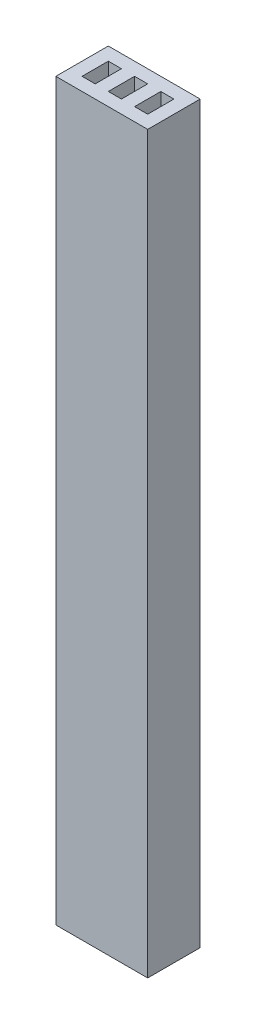
ISO-10303-21;
HEADER;
FILE_DESCRIPTION(('STEP AP214'),'2;1');
FILE_NAME('part.step','',(''),(''),'','','');
FILE_SCHEMA(('AUTOMOTIVE_DESIGN { 1 0 10303 214 1 1 1 1 }'));
ENDSEC;
DATA;
#1=APPLICATION_CONTEXT('core data for automotive mechanical design processes');
#2=APPLICATION_PROTOCOL_DEFINITION('international standard','automotive_design',2000,#1);
#3=PRODUCT_CONTEXT('',#1,'mechanical');
#4=PRODUCT('Part','Part','',(#3));
#5=PRODUCT_RELATED_PRODUCT_CATEGORY('part','',(#4));
#6=PRODUCT_DEFINITION_FORMATION('','',#4);
#7=PRODUCT_DEFINITION_CONTEXT('part definition',#1,'design');
#8=PRODUCT_DEFINITION('design','',#6,#7);
#9=PRODUCT_DEFINITION_SHAPE('','',#8);
#10=(LENGTH_UNIT() NAMED_UNIT(*) SI_UNIT(.MILLI.,.METRE.));
#11=(NAMED_UNIT(*) PLANE_ANGLE_UNIT() SI_UNIT($,.RADIAN.));
#12=(NAMED_UNIT(*) SI_UNIT($,.STERADIAN.) SOLID_ANGLE_UNIT());
#13=UNCERTAINTY_MEASURE_WITH_UNIT(LENGTH_MEASURE(1.E-05),#10,'distance_accuracy_value','');
#14=(GEOMETRIC_REPRESENTATION_CONTEXT(3) GLOBAL_UNCERTAINTY_ASSIGNED_CONTEXT((#13)) GLOBAL_UNIT_ASSIGNED_CONTEXT((#10,
#11,#12)) REPRESENTATION_CONTEXT('',''));
#15=CARTESIAN_POINT('',(0.,0.,0.));
#16=DIRECTION('',(0.,0.,1.));
#17=DIRECTION('',(1.,0.,0.));
#18=AXIS2_PLACEMENT_3D('',#15,#16,#17);
#19=CARTESIAN_POINT('',(0.,56.,0.));
#20=DIRECTION('',(0.,1.,0.));
#21=DIRECTION('',(0.,0.,1.));
#22=AXIS2_PLACEMENT_3D('',#19,#20,#21);
#23=PLANE('',#22);
#24=DIRECTION('',(0.,0.,-1.));
#25=VECTOR('',#24,1.);
#26=CARTESIAN_POINT('',(0.183947771505097,56.,0.763376857079086));
#27=LINE('',#26,#25);
#28=CARTESIAN_POINT('',(0.183947771505097,56.,4.76337685707909));
#29=VERTEX_POINT('',#28);
#30=CARTESIAN_POINT('',(0.183947771505097,56.,0.763376857079086));
#31=VERTEX_POINT('',#30);
#32=EDGE_CURVE('E244',#29,#31,#27,.T.);
#33=ORIENTED_EDGE('',*,*,#32,.T.);
#34=DIRECTION('',(-1.,0.,0.));
#35=VECTOR('',#34,1.);
#36=CARTESIAN_POINT('',(-6.8160522284949,56.,0.763376857079086));
#37=LINE('',#36,#35);
#38=CARTESIAN_POINT('',(-6.8160522284949,56.,0.763376857079086));
#39=VERTEX_POINT('',#38);
#40=EDGE_CURVE('E247',#31,#39,#37,.T.);
#41=ORIENTED_EDGE('',*,*,#40,.T.);
#42=DIRECTION('',(0.,0.,1.));
#43=VECTOR('',#42,1.);
#44=CARTESIAN_POINT('',(-6.8160522284949,56.,0.763376857079086));
#45=LINE('',#44,#43);
#46=CARTESIAN_POINT('',(-6.8160522284949,56.,4.76337685707909));
#47=VERTEX_POINT('',#46);
#48=EDGE_CURVE('E250',#39,#47,#45,.T.);
#49=ORIENTED_EDGE('',*,*,#48,.T.);
#50=DIRECTION('',(1.,0.,0.));
#51=VECTOR('',#50,1.);
#52=CARTESIAN_POINT('',(-6.8160522284949,56.,4.76337685707909));
#53=LINE('',#52,#51);
#54=EDGE_CURVE('E252',#47,#29,#53,.T.);
#55=ORIENTED_EDGE('',*,*,#54,.T.);
#56=EDGE_LOOP('',(#33,#41,#49,#55));
#57=FACE_BOUND('',#56,.T.);
#58=DIRECTION('',(1.,0.,0.));
#59=VECTOR('',#58,1.);
#60=CARTESIAN_POINT('',(-5.8160522284949,56.,3.76337685707909));
#61=LINE('',#60,#59);
#62=CARTESIAN_POINT('',(-5.8160522284949,56.,3.76337685707909));
#63=VERTEX_POINT('',#62);
#64=CARTESIAN_POINT('',(-4.8160522284949,56.,3.76337685707909));
#65=VERTEX_POINT('',#64);
#66=EDGE_CURVE('E215',#63,#65,#61,.T.);
#67=ORIENTED_EDGE('',*,*,#66,.F.);
#68=DIRECTION('',(0.,0.,1.));
#69=VECTOR('',#68,1.);
#70=CARTESIAN_POINT('',(-5.8160522284949,56.,3.76337685707909));
#71=LINE('',#70,#69);
#72=CARTESIAN_POINT('',(-5.8160522284949,56.,1.76337685707909));
#73=VERTEX_POINT('',#72);
#74=EDGE_CURVE('E213',#73,#63,#71,.T.);
#75=ORIENTED_EDGE('',*,*,#74,.F.);
#76=DIRECTION('',(-1.,0.,0.));
#77=VECTOR('',#76,1.);
#78=CARTESIAN_POINT('',(-5.8160522284949,56.,1.76337685707909));
#79=LINE('',#78,#77);
#80=CARTESIAN_POINT('',(-4.8160522284949,56.,1.76337685707909));
#81=VERTEX_POINT('',#80);
#82=EDGE_CURVE('E221',#81,#73,#79,.T.);
#83=ORIENTED_EDGE('',*,*,#82,.F.);
#84=DIRECTION('',(0.,0.,-1.));
#85=VECTOR('',#84,1.);
#86=CARTESIAN_POINT('',(-4.8160522284949,56.,3.76337685707909));
#87=LINE('',#86,#85);
#88=EDGE_CURVE('E218',#65,#81,#87,.T.);
#89=ORIENTED_EDGE('',*,*,#88,.F.);
#90=EDGE_LOOP('',(#67,#75,#83,#89));
#91=FACE_BOUND('',#90,.T.);
#92=DIRECTION('',(-1.,0.,0.));
#93=VECTOR('',#92,1.);
#94=CARTESIAN_POINT('',(-3.8160522284949,56.,1.76337685707909));
#95=LINE('',#94,#93);
#96=CARTESIAN_POINT('',(-2.8160522284949,56.,1.76337685707909));
#97=VERTEX_POINT('',#96);
#98=CARTESIAN_POINT('',(-3.8160522284949,56.,1.76337685707909));
#99=VERTEX_POINT('',#98);
#100=EDGE_CURVE('E184',#97,#99,#95,.T.);
#101=ORIENTED_EDGE('',*,*,#100,.F.);
#102=DIRECTION('',(0.,0.,-1.));
#103=VECTOR('',#102,1.);
#104=CARTESIAN_POINT('',(-2.8160522284949,56.,3.76337685707909));
#105=LINE('',#104,#103);
#106=CARTESIAN_POINT('',(-2.8160522284949,56.,3.76337685707909));
#107=VERTEX_POINT('',#106);
#108=EDGE_CURVE('E182',#107,#97,#105,.T.);
#109=ORIENTED_EDGE('',*,*,#108,.F.);
#110=DIRECTION('',(1.,0.,0.));
#111=VECTOR('',#110,1.);
#112=CARTESIAN_POINT('',(-3.8160522284949,56.,3.76337685707909));
#113=LINE('',#112,#111);
#114=CARTESIAN_POINT('',(-3.8160522284949,56.,3.76337685707909));
#115=VERTEX_POINT('',#114);
#116=EDGE_CURVE('E190',#115,#107,#113,.T.);
#117=ORIENTED_EDGE('',*,*,#116,.F.);
#118=DIRECTION('',(0.,0.,1.));
#119=VECTOR('',#118,1.);
#120=CARTESIAN_POINT('',(-3.8160522284949,56.,3.76337685707909));
#121=LINE('',#120,#119);
#122=EDGE_CURVE('E187',#99,#115,#121,.T.);
#123=ORIENTED_EDGE('',*,*,#122,.F.);
#124=EDGE_LOOP('',(#101,#109,#117,#123));
#125=FACE_BOUND('',#124,.T.);
#126=DIRECTION('',(-1.,0.,0.));
#127=VECTOR('',#126,1.);
#128=CARTESIAN_POINT('',(-1.8160522284949,56.,1.76337685707909));
#129=LINE('',#128,#127);
#130=CARTESIAN_POINT('',(-0.816052228494903,56.,1.76337685707909));
#131=VERTEX_POINT('',#130);
#132=CARTESIAN_POINT('',(-1.8160522284949,56.,1.76337685707909));
#133=VERTEX_POINT('',#132);
#134=EDGE_CURVE('E154',#131,#133,#129,.T.);
#135=ORIENTED_EDGE('',*,*,#134,.F.);
#136=DIRECTION('',(0.,0.,-1.));
#137=VECTOR('',#136,1.);
#138=CARTESIAN_POINT('',(-0.816052228494903,56.,3.76337685707909));
#139=LINE('',#138,#137);
#140=CARTESIAN_POINT('',(-0.816052228494903,56.,3.76337685707909));
#141=VERTEX_POINT('',#140);
#142=EDGE_CURVE('E146',#141,#131,#139,.T.);
#143=ORIENTED_EDGE('',*,*,#142,.F.);
#144=DIRECTION('',(1.,0.,0.));
#145=VECTOR('',#144,1.);
#146=CARTESIAN_POINT('',(-1.8160522284949,56.,3.76337685707909));
#147=LINE('',#146,#145);
#148=CARTESIAN_POINT('',(-1.8160522284949,56.,3.76337685707909));
#149=VERTEX_POINT('',#148);
#150=EDGE_CURVE('E168',#149,#141,#147,.T.);
#151=ORIENTED_EDGE('',*,*,#150,.F.);
#152=DIRECTION('',(0.,0.,1.));
#153=VECTOR('',#152,1.);
#154=CARTESIAN_POINT('',(-1.8160522284949,56.,3.76337685707909));
#155=LINE('',#154,#153);
#156=EDGE_CURVE('E166',#133,#149,#155,.T.);
#157=ORIENTED_EDGE('',*,*,#156,.F.);
#158=EDGE_LOOP('',(#135,#143,#151,#157));
#159=FACE_BOUND('',#158,.T.);
#160=ADVANCED_FACE('F33',(#57,#91,#125,#159),#23,.T.);
#161=CARTESIAN_POINT('',(0.,0.,0.));
#162=DIRECTION('',(0.,1.,0.));
#163=DIRECTION('',(0.,0.,1.));
#164=AXIS2_PLACEMENT_3D('',#161,#162,#163);
#165=PLANE('',#164);
#166=DIRECTION('',(0.,0.,-1.));
#167=VECTOR('',#166,1.);
#168=CARTESIAN_POINT('',(-2.8160522284949,0.,3.76337685707909));
#169=LINE('',#168,#167);
#170=CARTESIAN_POINT('',(-2.8160522284949,0.,3.76337685707909));
#171=VERTEX_POINT('',#170);
#172=CARTESIAN_POINT('',(-2.8160522284949,0.,1.76337685707909));
#173=VERTEX_POINT('',#172);
#174=EDGE_CURVE('E162',#171,#173,#169,.T.);
#175=ORIENTED_EDGE('',*,*,#174,.T.);
#176=DIRECTION('',(-1.,0.,0.));
#177=VECTOR('',#176,1.);
#178=CARTESIAN_POINT('',(-3.8160522284949,0.,1.76337685707909));
#179=LINE('',#178,#177);
#180=CARTESIAN_POINT('',(-3.8160522284949,0.,1.76337685707909));
#181=VERTEX_POINT('',#180);
#182=EDGE_CURVE('E195',#173,#181,#179,.T.);
#183=ORIENTED_EDGE('',*,*,#182,.T.);
#184=DIRECTION('',(0.,0.,1.));
#185=VECTOR('',#184,1.);
#186=CARTESIAN_POINT('',(-3.8160522284949,0.,3.76337685707909));
#187=LINE('',#186,#185);
#188=CARTESIAN_POINT('',(-3.8160522284949,0.,3.76337685707909));
#189=VERTEX_POINT('',#188);
#190=EDGE_CURVE('E198',#181,#189,#187,.T.);
#191=ORIENTED_EDGE('',*,*,#190,.T.);
#192=DIRECTION('',(1.,0.,0.));
#193=VECTOR('',#192,1.);
#194=CARTESIAN_POINT('',(-3.8160522284949,0.,3.76337685707909));
#195=LINE('',#194,#193);
#196=EDGE_CURVE('E185',#189,#171,#195,.T.);
#197=ORIENTED_EDGE('',*,*,#196,.T.);
#198=EDGE_LOOP('',(#175,#183,#191,#197));
#199=FACE_BOUND('',#198,.T.);
#200=DIRECTION('',(0.,0.,-1.));
#201=VECTOR('',#200,1.);
#202=CARTESIAN_POINT('',(0.183947771505097,0.,0.763376857079086));
#203=LINE('',#202,#201);
#204=CARTESIAN_POINT('',(0.183947771505097,0.,4.76337685707909));
#205=VERTEX_POINT('',#204);
#206=CARTESIAN_POINT('',(0.183947771505097,0.,0.763376857079086));
#207=VERTEX_POINT('',#206);
#208=EDGE_CURVE('E243',#205,#207,#203,.T.);
#209=ORIENTED_EDGE('',*,*,#208,.F.);
#210=DIRECTION('',(1.,0.,0.));
#211=VECTOR('',#210,1.);
#212=CARTESIAN_POINT('',(-6.8160522284949,0.,4.76337685707909));
#213=LINE('',#212,#211);
#214=CARTESIAN_POINT('',(-6.8160522284949,0.,4.76337685707909));
#215=VERTEX_POINT('',#214);
#216=EDGE_CURVE('E248',#215,#205,#213,.T.);
#217=ORIENTED_EDGE('',*,*,#216,.F.);
#218=DIRECTION('',(0.,0.,1.));
#219=VECTOR('',#218,1.);
#220=CARTESIAN_POINT('',(-6.8160522284949,0.,0.763376857079086));
#221=LINE('',#220,#219);
#222=CARTESIAN_POINT('',(-6.8160522284949,0.,0.763376857079086));
#223=VERTEX_POINT('',#222);
#224=EDGE_CURVE('E259',#223,#215,#221,.T.);
#225=ORIENTED_EDGE('',*,*,#224,.F.);
#226=DIRECTION('',(-1.,0.,0.));
#227=VECTOR('',#226,1.);
#228=CARTESIAN_POINT('',(-6.8160522284949,0.,0.763376857079086));
#229=LINE('',#228,#227);
#230=EDGE_CURVE('E257',#207,#223,#229,.T.);
#231=ORIENTED_EDGE('',*,*,#230,.F.);
#232=EDGE_LOOP('',(#209,#217,#225,#231));
#233=FACE_BOUND('',#232,.T.);
#234=DIRECTION('',(0.,0.,1.));
#235=VECTOR('',#234,1.);
#236=CARTESIAN_POINT('',(-5.8160522284949,0.,3.76337685707909));
#237=LINE('',#236,#235);
#238=CARTESIAN_POINT('',(-5.8160522284949,0.,1.76337685707909));
#239=VERTEX_POINT('',#238);
#240=CARTESIAN_POINT('',(-5.8160522284949,0.,3.76337685707909));
#241=VERTEX_POINT('',#240);
#242=EDGE_CURVE('E212',#239,#241,#237,.T.);
#243=ORIENTED_EDGE('',*,*,#242,.T.);
#244=DIRECTION('',(1.,0.,0.));
#245=VECTOR('',#244,1.);
#246=CARTESIAN_POINT('',(-5.8160522284949,0.,3.76337685707909));
#247=LINE('',#246,#245);
#248=CARTESIAN_POINT('',(-4.8160522284949,0.,3.76337685707909));
#249=VERTEX_POINT('',#248);
#250=EDGE_CURVE('E226',#241,#249,#247,.T.);
#251=ORIENTED_EDGE('',*,*,#250,.T.);
#252=DIRECTION('',(0.,0.,-1.));
#253=VECTOR('',#252,1.);
#254=CARTESIAN_POINT('',(-4.8160522284949,0.,3.76337685707909));
#255=LINE('',#254,#253);
#256=CARTESIAN_POINT('',(-4.8160522284949,0.,1.76337685707909));
#257=VERTEX_POINT('',#256);
#258=EDGE_CURVE('E229',#249,#257,#255,.T.);
#259=ORIENTED_EDGE('',*,*,#258,.T.);
#260=DIRECTION('',(-1.,0.,0.));
#261=VECTOR('',#260,1.);
#262=CARTESIAN_POINT('',(-5.8160522284949,0.,1.76337685707909));
#263=LINE('',#262,#261);
#264=EDGE_CURVE('E216',#257,#239,#263,.T.);
#265=ORIENTED_EDGE('',*,*,#264,.T.);
#266=EDGE_LOOP('',(#243,#251,#259,#265));
#267=FACE_BOUND('',#266,.T.);
#268=DIRECTION('',(0.,0.,-1.));
#269=VECTOR('',#268,1.);
#270=CARTESIAN_POINT('',(-0.816052228494903,0.,3.76337685707909));
#271=LINE('',#270,#269);
#272=CARTESIAN_POINT('',(-0.816052228494903,0.,3.76337685707909));
#273=VERTEX_POINT('',#272);
#274=CARTESIAN_POINT('',(-0.816052228494903,0.,1.76337685707909));
#275=VERTEX_POINT('',#274);
#276=EDGE_CURVE('E56',#273,#275,#271,.T.);
#277=ORIENTED_EDGE('',*,*,#276,.T.);
#278=DIRECTION('',(-1.,0.,0.));
#279=VECTOR('',#278,1.);
#280=CARTESIAN_POINT('',(-1.8160522284949,0.,1.76337685707909));
#281=LINE('',#280,#279);
#282=CARTESIAN_POINT('',(-1.8160522284949,0.,1.76337685707909));
#283=VERTEX_POINT('',#282);
#284=EDGE_CURVE('E161',#275,#283,#281,.T.);
#285=ORIENTED_EDGE('',*,*,#284,.T.);
#286=DIRECTION('',(0.,0.,1.));
#287=VECTOR('',#286,1.);
#288=CARTESIAN_POINT('',(-1.8160522284949,0.,3.76337685707909));
#289=LINE('',#288,#287);
#290=CARTESIAN_POINT('',(-1.8160522284949,0.,3.76337685707909));
#291=VERTEX_POINT('',#290);
#292=EDGE_CURVE('E174',#283,#291,#289,.T.);
#293=ORIENTED_EDGE('',*,*,#292,.T.);
#294=DIRECTION('',(1.,0.,0.));
#295=VECTOR('',#294,1.);
#296=CARTESIAN_POINT('',(-1.8160522284949,0.,3.76337685707909));
#297=LINE('',#296,#295);
#298=EDGE_CURVE('E155',#291,#273,#297,.T.);
#299=ORIENTED_EDGE('',*,*,#298,.T.);
#300=EDGE_LOOP('',(#277,#285,#293,#299));
#301=FACE_BOUND('',#300,.T.);
#302=ADVANCED_FACE('F277',(#199,#233,#267,#301),#165,.F.);
#303=CARTESIAN_POINT('',(0.183947771505097,56.,0.763376857079086));
#304=DIRECTION('',(-1.,0.,0.));
#305=DIRECTION('',(0.,0.,1.));
#306=AXIS2_PLACEMENT_3D('',#303,#304,#305);
#307=PLANE('',#306);
#308=ORIENTED_EDGE('',*,*,#208,.T.);
#309=DIRECTION('',(0.,-1.,0.));
#310=VECTOR('',#309,1.);
#311=CARTESIAN_POINT('',(0.183947771505097,56.,0.763376857079086));
#312=LINE('',#311,#310);
#313=EDGE_CURVE('E11',#31,#207,#312,.T.);
#314=ORIENTED_EDGE('',*,*,#313,.F.);
#315=ORIENTED_EDGE('',*,*,#32,.F.);
#316=DIRECTION('',(0.,-1.,0.));
#317=VECTOR('',#316,1.);
#318=CARTESIAN_POINT('',(0.183947771505097,56.,4.76337685707909));
#319=LINE('',#318,#317);
#320=EDGE_CURVE('E254',#29,#205,#319,.T.);
#321=ORIENTED_EDGE('',*,*,#320,.T.);
#322=EDGE_LOOP('',(#308,#314,#315,#321));
#323=FACE_BOUND('',#322,.T.);
#324=ADVANCED_FACE('F35',(#323),#307,.F.);
#325=CARTESIAN_POINT('',(-6.8160522284949,56.,0.763376857079086));
#326=DIRECTION('',(0.,0.,1.));
#327=DIRECTION('',(1.,0.,0.));
#328=AXIS2_PLACEMENT_3D('',#325,#326,#327);
#329=PLANE('',#328);
#330=ORIENTED_EDGE('',*,*,#230,.T.);
#331=DIRECTION('',(0.,-1.,0.));
#332=VECTOR('',#331,1.);
#333=CARTESIAN_POINT('',(-6.8160522284949,56.,0.763376857079086));
#334=LINE('',#333,#332);
#335=EDGE_CURVE('E41',#39,#223,#334,.T.);
#336=ORIENTED_EDGE('',*,*,#335,.F.);
#337=ORIENTED_EDGE('',*,*,#40,.F.);
#338=ORIENTED_EDGE('',*,*,#313,.T.);
#339=EDGE_LOOP('',(#330,#336,#337,#338));
#340=FACE_BOUND('',#339,.T.);
#341=ADVANCED_FACE('F288',(#340),#329,.F.);
#342=CARTESIAN_POINT('',(-6.8160522284949,56.,0.763376857079086));
#343=DIRECTION('',(1.,0.,0.));
#344=DIRECTION('',(0.,0.,-1.));
#345=AXIS2_PLACEMENT_3D('',#342,#343,#344);
#346=PLANE('',#345);
#347=ORIENTED_EDGE('',*,*,#224,.T.);
#348=DIRECTION('',(0.,-1.,0.));
#349=VECTOR('',#348,1.);
#350=CARTESIAN_POINT('',(-6.8160522284949,56.,4.76337685707909));
#351=LINE('',#350,#349);
#352=EDGE_CURVE('E264',#47,#215,#351,.T.);
#353=ORIENTED_EDGE('',*,*,#352,.F.);
#354=ORIENTED_EDGE('',*,*,#48,.F.);
#355=ORIENTED_EDGE('',*,*,#335,.T.);
#356=EDGE_LOOP('',(#347,#353,#354,#355));
#357=FACE_BOUND('',#356,.T.);
#358=ADVANCED_FACE('F271',(#357),#346,.F.);
#359=CARTESIAN_POINT('',(-6.8160522284949,56.,4.76337685707909));
#360=DIRECTION('',(0.,0.,-1.));
#361=DIRECTION('',(-1.,0.,0.));
#362=AXIS2_PLACEMENT_3D('',#359,#360,#361);
#363=PLANE('',#362);
#364=ORIENTED_EDGE('',*,*,#216,.T.);
#365=ORIENTED_EDGE('',*,*,#320,.F.);
#366=ORIENTED_EDGE('',*,*,#54,.F.);
#367=ORIENTED_EDGE('',*,*,#352,.T.);
#368=EDGE_LOOP('',(#364,#365,#366,#367));
#369=FACE_BOUND('',#368,.T.);
#370=ADVANCED_FACE('F281',(#369),#363,.F.);
#371=CARTESIAN_POINT('',(-5.8160522284949,56.,3.76337685707909));
#372=DIRECTION('',(1.,0.,0.));
#373=DIRECTION('',(0.,0.,-1.));
#374=AXIS2_PLACEMENT_3D('',#371,#372,#373);
#375=PLANE('',#374);
#376=ORIENTED_EDGE('',*,*,#242,.F.);
#377=DIRECTION('',(0.,-1.,0.));
#378=VECTOR('',#377,1.);
#379=CARTESIAN_POINT('',(-5.8160522284949,56.,1.76337685707909));
#380=LINE('',#379,#378);
#381=EDGE_CURVE('E223',#73,#239,#380,.T.);
#382=ORIENTED_EDGE('',*,*,#381,.F.);
#383=ORIENTED_EDGE('',*,*,#74,.T.);
#384=DIRECTION('',(0.,-1.,0.));
#385=VECTOR('',#384,1.);
#386=CARTESIAN_POINT('',(-5.8160522284949,56.,3.76337685707909));
#387=LINE('',#386,#385);
#388=EDGE_CURVE('E240',#63,#241,#387,.T.);
#389=ORIENTED_EDGE('',*,*,#388,.T.);
#390=EDGE_LOOP('',(#376,#382,#383,#389));
#391=FACE_BOUND('',#390,.T.);
#392=ADVANCED_FACE('F303',(#391),#375,.T.);
#393=CARTESIAN_POINT('',(-5.8160522284949,56.,3.76337685707909));
#394=DIRECTION('',(0.,0.,-1.));
#395=DIRECTION('',(-1.,0.,0.));
#396=AXIS2_PLACEMENT_3D('',#393,#394,#395);
#397=PLANE('',#396);
#398=ORIENTED_EDGE('',*,*,#250,.F.);
#399=ORIENTED_EDGE('',*,*,#388,.F.);
#400=ORIENTED_EDGE('',*,*,#66,.T.);
#401=DIRECTION('',(0.,-1.,0.));
#402=VECTOR('',#401,1.);
#403=CARTESIAN_POINT('',(-4.8160522284949,56.,3.76337685707909));
#404=LINE('',#403,#402);
#405=EDGE_CURVE('E238',#65,#249,#404,.T.);
#406=ORIENTED_EDGE('',*,*,#405,.T.);
#407=EDGE_LOOP('',(#398,#399,#400,#406));
#408=FACE_BOUND('',#407,.T.);
#409=ADVANCED_FACE('F310',(#408),#397,.T.);
#410=CARTESIAN_POINT('',(-4.8160522284949,56.,3.76337685707909));
#411=DIRECTION('',(-1.,0.,0.));
#412=DIRECTION('',(0.,0.,1.));
#413=AXIS2_PLACEMENT_3D('',#410,#411,#412);
#414=PLANE('',#413);
#415=ORIENTED_EDGE('',*,*,#258,.F.);
#416=ORIENTED_EDGE('',*,*,#405,.F.);
#417=ORIENTED_EDGE('',*,*,#88,.T.);
#418=DIRECTION('',(0.,-1.,0.));
#419=VECTOR('',#418,1.);
#420=CARTESIAN_POINT('',(-4.8160522284949,56.,1.76337685707909));
#421=LINE('',#420,#419);
#422=EDGE_CURVE('E236',#81,#257,#421,.T.);
#423=ORIENTED_EDGE('',*,*,#422,.T.);
#424=EDGE_LOOP('',(#415,#416,#417,#423));
#425=FACE_BOUND('',#424,.T.);
#426=ADVANCED_FACE('F315',(#425),#414,.T.);
#427=CARTESIAN_POINT('',(-5.8160522284949,56.,1.76337685707909));
#428=DIRECTION('',(0.,0.,1.));
#429=DIRECTION('',(1.,0.,0.));
#430=AXIS2_PLACEMENT_3D('',#427,#428,#429);
#431=PLANE('',#430);
#432=ORIENTED_EDGE('',*,*,#264,.F.);
#433=ORIENTED_EDGE('',*,*,#422,.F.);
#434=ORIENTED_EDGE('',*,*,#82,.T.);
#435=ORIENTED_EDGE('',*,*,#381,.T.);
#436=EDGE_LOOP('',(#432,#433,#434,#435));
#437=FACE_BOUND('',#436,.T.);
#438=ADVANCED_FACE('F322',(#437),#431,.T.);
#439=CARTESIAN_POINT('',(-2.8160522284949,56.,3.76337685707909));
#440=DIRECTION('',(-1.,0.,0.));
#441=DIRECTION('',(0.,0.,1.));
#442=AXIS2_PLACEMENT_3D('',#439,#440,#441);
#443=PLANE('',#442);
#444=ORIENTED_EDGE('',*,*,#174,.F.);
#445=DIRECTION('',(0.,-1.,0.));
#446=VECTOR('',#445,1.);
#447=CARTESIAN_POINT('',(-2.8160522284949,56.,3.76337685707909));
#448=LINE('',#447,#446);
#449=EDGE_CURVE('E192',#107,#171,#448,.T.);
#450=ORIENTED_EDGE('',*,*,#449,.F.);
#451=ORIENTED_EDGE('',*,*,#108,.T.);
#452=DIRECTION('',(0.,-1.,0.));
#453=VECTOR('',#452,1.);
#454=CARTESIAN_POINT('',(-2.8160522284949,56.,1.76337685707909));
#455=LINE('',#454,#453);
#456=EDGE_CURVE('E209',#97,#173,#455,.T.);
#457=ORIENTED_EDGE('',*,*,#456,.T.);
#458=EDGE_LOOP('',(#444,#450,#451,#457));
#459=FACE_BOUND('',#458,.T.);
#460=ADVANCED_FACE('F344',(#459),#443,.T.);
#461=CARTESIAN_POINT('',(-3.8160522284949,56.,1.76337685707909));
#462=DIRECTION('',(0.,0.,1.));
#463=DIRECTION('',(1.,0.,0.));
#464=AXIS2_PLACEMENT_3D('',#461,#462,#463);
#465=PLANE('',#464);
#466=ORIENTED_EDGE('',*,*,#182,.F.);
#467=ORIENTED_EDGE('',*,*,#456,.F.);
#468=ORIENTED_EDGE('',*,*,#100,.T.);
#469=DIRECTION('',(0.,-1.,0.));
#470=VECTOR('',#469,1.);
#471=CARTESIAN_POINT('',(-3.8160522284949,56.,1.76337685707909));
#472=LINE('',#471,#470);
#473=EDGE_CURVE('E207',#99,#181,#472,.T.);
#474=ORIENTED_EDGE('',*,*,#473,.T.);
#475=EDGE_LOOP('',(#466,#467,#468,#474));
#476=FACE_BOUND('',#475,.T.);
#477=ADVANCED_FACE('F338',(#476),#465,.T.);
#478=CARTESIAN_POINT('',(-3.8160522284949,56.,3.76337685707909));
#479=DIRECTION('',(1.,0.,0.));
#480=DIRECTION('',(0.,0.,-1.));
#481=AXIS2_PLACEMENT_3D('',#478,#479,#480);
#482=PLANE('',#481);
#483=ORIENTED_EDGE('',*,*,#190,.F.);
#484=ORIENTED_EDGE('',*,*,#473,.F.);
#485=ORIENTED_EDGE('',*,*,#122,.T.);
#486=DIRECTION('',(0.,-1.,0.));
#487=VECTOR('',#486,1.);
#488=CARTESIAN_POINT('',(-3.8160522284949,56.,3.76337685707909));
#489=LINE('',#488,#487);
#490=EDGE_CURVE('E205',#115,#189,#489,.T.);
#491=ORIENTED_EDGE('',*,*,#490,.T.);
#492=EDGE_LOOP('',(#483,#484,#485,#491));
#493=FACE_BOUND('',#492,.T.);
#494=ADVANCED_FACE('F341',(#493),#482,.T.);
#495=CARTESIAN_POINT('',(-3.8160522284949,56.,3.76337685707909));
#496=DIRECTION('',(0.,0.,-1.));
#497=DIRECTION('',(-1.,0.,0.));
#498=AXIS2_PLACEMENT_3D('',#495,#496,#497);
#499=PLANE('',#498);
#500=ORIENTED_EDGE('',*,*,#196,.F.);
#501=ORIENTED_EDGE('',*,*,#490,.F.);
#502=ORIENTED_EDGE('',*,*,#116,.T.);
#503=ORIENTED_EDGE('',*,*,#449,.T.);
#504=EDGE_LOOP('',(#500,#501,#502,#503));
#505=FACE_BOUND('',#504,.T.);
#506=ADVANCED_FACE('F347',(#505),#499,.T.);
#507=CARTESIAN_POINT('',(-0.816052228494903,56.,3.76337685707909));
#508=DIRECTION('',(-1.,0.,0.));
#509=DIRECTION('',(0.,0.,1.));
#510=AXIS2_PLACEMENT_3D('',#507,#508,#509);
#511=PLANE('',#510);
#512=ORIENTED_EDGE('',*,*,#276,.F.);
#513=DIRECTION('',(0.,-1.,0.));
#514=VECTOR('',#513,1.);
#515=CARTESIAN_POINT('',(-0.816052228494903,56.,3.76337685707909));
#516=LINE('',#515,#514);
#517=EDGE_CURVE('E150',#141,#273,#516,.T.);
#518=ORIENTED_EDGE('',*,*,#517,.F.);
#519=ORIENTED_EDGE('',*,*,#142,.T.);
#520=DIRECTION('',(0.,-1.,0.));
#521=VECTOR('',#520,1.);
#522=CARTESIAN_POINT('',(-0.816052228494903,56.,1.76337685707909));
#523=LINE('',#522,#521);
#524=EDGE_CURVE('E149',#131,#275,#523,.T.);
#525=ORIENTED_EDGE('',*,*,#524,.T.);
#526=EDGE_LOOP('',(#512,#518,#519,#525));
#527=FACE_BOUND('',#526,.T.);
#528=ADVANCED_FACE('F148',(#527),#511,.T.);
#529=CARTESIAN_POINT('',(-1.8160522284949,56.,1.76337685707909));
#530=DIRECTION('',(0.,0.,1.));
#531=DIRECTION('',(1.,0.,0.));
#532=AXIS2_PLACEMENT_3D('',#529,#530,#531);
#533=PLANE('',#532);
#534=ORIENTED_EDGE('',*,*,#284,.F.);
#535=ORIENTED_EDGE('',*,*,#524,.F.);
#536=ORIENTED_EDGE('',*,*,#134,.T.);
#537=DIRECTION('',(0.,-1.,0.));
#538=VECTOR('',#537,1.);
#539=CARTESIAN_POINT('',(-1.8160522284949,56.,1.76337685707909));
#540=LINE('',#539,#538);
#541=EDGE_CURVE('E163',#133,#283,#540,.T.);
#542=ORIENTED_EDGE('',*,*,#541,.T.);
#543=EDGE_LOOP('',(#534,#535,#536,#542));
#544=FACE_BOUND('',#543,.T.);
#545=ADVANCED_FACE('F158',(#544),#533,.T.);
#546=CARTESIAN_POINT('',(-1.8160522284949,56.,3.76337685707909));
#547=DIRECTION('',(1.,0.,0.));
#548=DIRECTION('',(0.,0.,-1.));
#549=AXIS2_PLACEMENT_3D('',#546,#547,#548);
#550=PLANE('',#549);
#551=ORIENTED_EDGE('',*,*,#292,.F.);
#552=ORIENTED_EDGE('',*,*,#541,.F.);
#553=ORIENTED_EDGE('',*,*,#156,.T.);
#554=DIRECTION('',(0.,-1.,0.));
#555=VECTOR('',#554,1.);
#556=CARTESIAN_POINT('',(-1.8160522284949,56.,3.76337685707909));
#557=LINE('',#556,#555);
#558=EDGE_CURVE('E48',#149,#291,#557,.T.);
#559=ORIENTED_EDGE('',*,*,#558,.T.);
#560=EDGE_LOOP('',(#551,#552,#553,#559));
#561=FACE_BOUND('',#560,.T.);
#562=ADVANCED_FACE('F404',(#561),#550,.T.);
#563=CARTESIAN_POINT('',(-1.8160522284949,56.,3.76337685707909));
#564=DIRECTION('',(0.,0.,-1.));
#565=DIRECTION('',(-1.,0.,0.));
#566=AXIS2_PLACEMENT_3D('',#563,#564,#565);
#567=PLANE('',#566);
#568=ORIENTED_EDGE('',*,*,#298,.F.);
#569=ORIENTED_EDGE('',*,*,#558,.F.);
#570=ORIENTED_EDGE('',*,*,#150,.T.);
#571=ORIENTED_EDGE('',*,*,#517,.T.);
#572=EDGE_LOOP('',(#568,#569,#570,#571));
#573=FACE_BOUND('',#572,.T.);
#574=ADVANCED_FACE('F412',(#573),#567,.T.);
#575=CLOSED_SHELL('',(#160,#302,#324,#341,#358,#370,#392,#409,#426,#438,#460,#477,#494,#506,
#528,#545,#562,#574));
#576=MANIFOLD_SOLID_BREP('B2',#575);
#577=ADVANCED_BREP_SHAPE_REPRESENTATION('',(#18,#576),#14);
#578=SHAPE_DEFINITION_REPRESENTATION(#9,#577);
ENDSEC;
END-ISO-10303-21;
